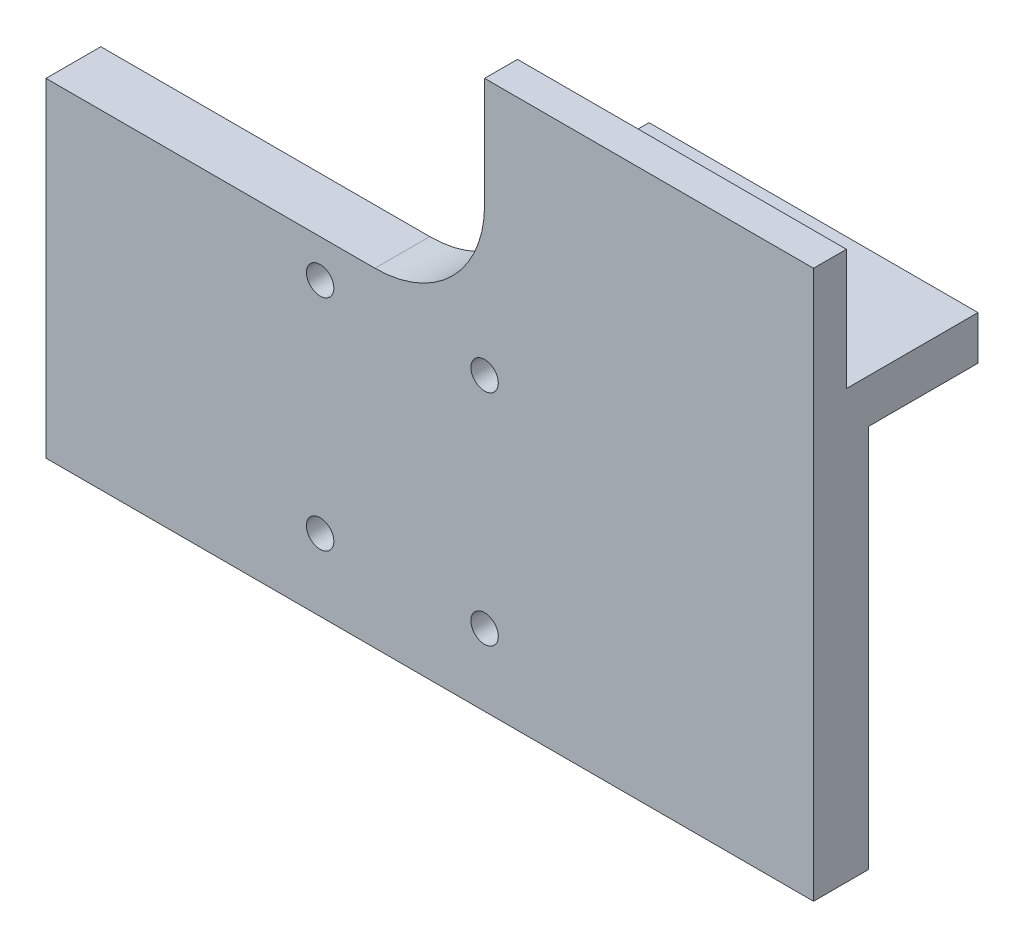
ISO-10303-21;
HEADER;
FILE_DESCRIPTION(('STEP AP214'),'2;1');
FILE_NAME('part.step','',(''),(''),'','','');
FILE_SCHEMA(('AUTOMOTIVE_DESIGN { 1 0 10303 214 1 1 1 1 }'));
ENDSEC;
DATA;
#1=APPLICATION_CONTEXT('core data for automotive mechanical design processes');
#2=APPLICATION_PROTOCOL_DEFINITION('international standard','automotive_design',2000,#1);
#3=PRODUCT_CONTEXT('',#1,'mechanical');
#4=PRODUCT('Part','Part','',(#3));
#5=PRODUCT_RELATED_PRODUCT_CATEGORY('part','',(#4));
#6=PRODUCT_DEFINITION_FORMATION('','',#4);
#7=PRODUCT_DEFINITION_CONTEXT('part definition',#1,'design');
#8=PRODUCT_DEFINITION('design','',#6,#7);
#9=PRODUCT_DEFINITION_SHAPE('','',#8);
#10=(LENGTH_UNIT() NAMED_UNIT(*) SI_UNIT(.MILLI.,.METRE.));
#11=(NAMED_UNIT(*) PLANE_ANGLE_UNIT() SI_UNIT($,.RADIAN.));
#12=(NAMED_UNIT(*) SI_UNIT($,.STERADIAN.) SOLID_ANGLE_UNIT());
#13=UNCERTAINTY_MEASURE_WITH_UNIT(LENGTH_MEASURE(1.E-05),#10,'distance_accuracy_value','');
#14=(GEOMETRIC_REPRESENTATION_CONTEXT(3) GLOBAL_UNCERTAINTY_ASSIGNED_CONTEXT((#13)) GLOBAL_UNIT_ASSIGNED_CONTEXT((#10,
#11,#12)) REPRESENTATION_CONTEXT('',''));
#15=CARTESIAN_POINT('',(0.,0.,0.));
#16=DIRECTION('',(0.,0.,1.));
#17=DIRECTION('',(1.,0.,0.));
#18=AXIS2_PLACEMENT_3D('',#15,#16,#17);
#19=CARTESIAN_POINT('',(30.,40.,0.));
#20=DIRECTION('',(0.,0.,1.));
#21=DIRECTION('',(1.,0.,0.));
#22=AXIS2_PLACEMENT_3D('',#19,#20,#21);
#23=PLANE('',#22);
#24=CARTESIAN_POINT('',(40.,26.55,0.));
#25=DIRECTION('',(0.,0.,1.));
#26=DIRECTION('',(1.,0.,0.));
#27=AXIS2_PLACEMENT_3D('',#24,#25,#26);
#28=CIRCLE('',#27,1.525);
#29=CARTESIAN_POINT('',(41.525,26.55,0.));
#30=VERTEX_POINT('',#29);
#31=EDGE_CURVE('E45',#30,#30,#28,.T.);
#32=ORIENTED_EDGE('',*,*,#31,.T.);
#33=EDGE_LOOP('',(#32));
#34=FACE_BOUND('',#33,.T.);
#35=CARTESIAN_POINT('',(25.,26.55,0.));
#36=DIRECTION('',(0.,0.,1.));
#37=DIRECTION('',(1.,0.,0.));
#38=AXIS2_PLACEMENT_3D('',#35,#36,#37);
#39=CIRCLE('',#38,1.525);
#40=CARTESIAN_POINT('',(26.525,26.55,0.));
#41=VERTEX_POINT('',#40);
#42=EDGE_CURVE('E246',#41,#41,#39,.T.);
#43=ORIENTED_EDGE('',*,*,#42,.T.);
#44=EDGE_LOOP('',(#43));
#45=FACE_BOUND('',#44,.T.);
#46=CARTESIAN_POINT('',(25.,6.55,0.));
#47=DIRECTION('',(0.,0.,1.));
#48=DIRECTION('',(1.,0.,0.));
#49=AXIS2_PLACEMENT_3D('',#46,#47,#48);
#50=CIRCLE('',#49,1.525);
#51=CARTESIAN_POINT('',(26.525,6.55,0.));
#52=VERTEX_POINT('',#51);
#53=EDGE_CURVE('E189',#52,#52,#50,.T.);
#54=ORIENTED_EDGE('',*,*,#53,.T.);
#55=EDGE_LOOP('',(#54));
#56=FACE_BOUND('',#55,.T.);
#57=CARTESIAN_POINT('',(40.,6.55,0.));
#58=DIRECTION('',(0.,0.,1.));
#59=DIRECTION('',(1.,0.,0.));
#60=AXIS2_PLACEMENT_3D('',#57,#58,#59);
#61=CIRCLE('',#60,1.525);
#62=CARTESIAN_POINT('',(41.525,6.55,0.));
#63=VERTEX_POINT('',#62);
#64=EDGE_CURVE('E183',#63,#63,#61,.T.);
#65=ORIENTED_EDGE('',*,*,#64,.T.);
#66=EDGE_LOOP('',(#65));
#67=FACE_BOUND('',#66,.T.);
#68=DIRECTION('',(0.,1.,0.));
#69=VECTOR('',#68,1.);
#70=CARTESIAN_POINT('',(40.,38.,0.));
#71=LINE('',#70,#69);
#72=CARTESIAN_POINT('',(40.,35.,0.));
#73=VERTEX_POINT('',#72);
#74=CARTESIAN_POINT('',(40.,39.,0.));
#75=VERTEX_POINT('',#74);
#76=EDGE_CURVE('E169',#73,#75,#71,.T.);
#77=ORIENTED_EDGE('',*,*,#76,.F.);
#78=DIRECTION('',(-1.,0.,0.));
#79=VECTOR('',#78,1.);
#80=CARTESIAN_POINT('',(70.,35.,0.));
#81=LINE('',#80,#79);
#82=CARTESIAN_POINT('',(70.,35.,0.));
#83=VERTEX_POINT('',#82);
#84=EDGE_CURVE('E147',#83,#73,#81,.T.);
#85=ORIENTED_EDGE('',*,*,#84,.F.);
#86=DIRECTION('',(0.,1.,0.));
#87=VECTOR('',#86,1.);
#88=CARTESIAN_POINT('',(70.,50.,0.));
#89=LINE('',#88,#87);
#90=CARTESIAN_POINT('',(70.,0.,0.));
#91=VERTEX_POINT('',#90);
#92=EDGE_CURVE('E143',#91,#83,#89,.T.);
#93=ORIENTED_EDGE('',*,*,#92,.F.);
#94=DIRECTION('',(1.,0.,0.));
#95=VECTOR('',#94,1.);
#96=CARTESIAN_POINT('',(0.,0.,0.));
#97=LINE('',#96,#95);
#98=CARTESIAN_POINT('',(0.,0.,0.));
#99=VERTEX_POINT('',#98);
#100=EDGE_CURVE('E218',#99,#91,#97,.T.);
#101=ORIENTED_EDGE('',*,*,#100,.F.);
#102=DIRECTION('',(0.,-1.,0.));
#103=VECTOR('',#102,1.);
#104=CARTESIAN_POINT('',(0.,0.,0.));
#105=LINE('',#104,#103);
#106=CARTESIAN_POINT('',(0.,30.,0.));
#107=VERTEX_POINT('',#106);
#108=EDGE_CURVE('E198',#107,#99,#105,.T.);
#109=ORIENTED_EDGE('',*,*,#108,.F.);
#110=DIRECTION('',(-1.,0.,0.));
#111=VECTOR('',#110,1.);
#112=CARTESIAN_POINT('',(0.,30.,0.));
#113=LINE('',#112,#111);
#114=CARTESIAN_POINT('',(30.,30.,0.));
#115=VERTEX_POINT('',#114);
#116=EDGE_CURVE('E203',#115,#107,#113,.T.);
#117=ORIENTED_EDGE('',*,*,#116,.F.);
#118=CARTESIAN_POINT('',(30.,40.,0.));
#119=DIRECTION('',(0.,0.,-1.));
#120=DIRECTION('',(1.,0.,0.));
#121=AXIS2_PLACEMENT_3D('',#118,#119,#120);
#122=CIRCLE('',#121,10.);
#123=CARTESIAN_POINT('',(40.,40.,0.));
#124=VERTEX_POINT('',#123);
#125=EDGE_CURVE('E221',#124,#115,#122,.T.);
#126=ORIENTED_EDGE('',*,*,#125,.F.);
#127=EDGE_CURVE('E173',#75,#124,#71,.T.);
#128=ORIENTED_EDGE('',*,*,#127,.F.);
#129=EDGE_LOOP('',(#77,#85,#93,#101,#109,#117,#126,#128));
#130=FACE_BOUND('',#129,.T.);
#131=ADVANCED_FACE('F37',(#34,#45,#56,#67,#130),#23,.F.);
#132=CARTESIAN_POINT('',(40.,38.,0.));
#133=DIRECTION('',(-1.,0.,0.));
#134=DIRECTION('',(0.,0.,1.));
#135=AXIS2_PLACEMENT_3D('',#132,#133,#134);
#136=PLANE('',#135);
#137=DIRECTION('',(0.,0.,1.));
#138=VECTOR('',#137,1.);
#139=CARTESIAN_POINT('',(40.,39.,-10.));
#140=LINE('',#139,#138);
#141=CARTESIAN_POINT('',(40.,39.,2.));
#142=VERTEX_POINT('',#141);
#143=EDGE_CURVE('E52',#75,#142,#140,.T.);
#144=ORIENTED_EDGE('',*,*,#143,.F.);
#145=ORIENTED_EDGE('',*,*,#127,.T.);
#146=DIRECTION('',(0.,0.,-1.));
#147=VECTOR('',#146,1.);
#148=CARTESIAN_POINT('',(40.,40.,5.));
#149=LINE('',#148,#147);
#150=CARTESIAN_POINT('',(40.,40.,2.));
#151=VERTEX_POINT('',#150);
#152=EDGE_CURVE('E172',#124,#151,#149,.F.);
#153=ORIENTED_EDGE('',*,*,#152,.T.);
#154=DIRECTION('',(0.,1.,0.));
#155=VECTOR('',#154,1.);
#156=CARTESIAN_POINT('',(40.,38.,2.));
#157=LINE('',#156,#155);
#158=EDGE_CURVE('E176',#142,#151,#157,.T.);
#159=ORIENTED_EDGE('',*,*,#158,.F.);
#160=EDGE_LOOP('',(#144,#145,#153,#159));
#161=FACE_BOUND('',#160,.T.);
#162=ADVANCED_FACE('F290',(#161),#136,.F.);
#163=CARTESIAN_POINT('',(40.,38.,2.));
#164=DIRECTION('',(0.,0.,1.));
#165=DIRECTION('',(1.,0.,0.));
#166=AXIS2_PLACEMENT_3D('',#163,#164,#165);
#167=PLANE('',#166);
#168=DIRECTION('',(1.,0.,0.));
#169=VECTOR('',#168,1.);
#170=CARTESIAN_POINT('',(70.,39.,2.));
#171=LINE('',#170,#169);
#172=CARTESIAN_POINT('',(70.,39.,2.));
#173=VERTEX_POINT('',#172);
#174=EDGE_CURVE('E60',#142,#173,#171,.T.);
#175=ORIENTED_EDGE('',*,*,#174,.F.);
#176=ORIENTED_EDGE('',*,*,#158,.T.);
#177=CARTESIAN_POINT('',(40.,50.,2.));
#178=VERTEX_POINT('',#177);
#179=EDGE_CURVE('E168',#151,#178,#157,.T.);
#180=ORIENTED_EDGE('',*,*,#179,.T.);
#181=DIRECTION('',(1.,0.,0.));
#182=VECTOR('',#181,1.);
#183=CARTESIAN_POINT('',(40.,50.,2.));
#184=LINE('',#183,#182);
#185=CARTESIAN_POINT('',(70.,50.,2.));
#186=VERTEX_POINT('',#185);
#187=EDGE_CURVE('E165',#178,#186,#184,.T.);
#188=ORIENTED_EDGE('',*,*,#187,.T.);
#189=DIRECTION('',(0.,1.,0.));
#190=VECTOR('',#189,1.);
#191=CARTESIAN_POINT('',(70.,38.,2.));
#192=LINE('',#191,#190);
#193=EDGE_CURVE('E174',#173,#186,#192,.T.);
#194=ORIENTED_EDGE('',*,*,#193,.F.);
#195=EDGE_LOOP('',(#175,#176,#180,#188,#194));
#196=FACE_BOUND('',#195,.T.);
#197=ADVANCED_FACE('F267',(#196),#167,.F.);
#198=CARTESIAN_POINT('',(40.,26.55,5.));
#199=DIRECTION('',(0.,0.,1.));
#200=DIRECTION('',(1.,0.,0.));
#201=AXIS2_PLACEMENT_3D('',#198,#199,#200);
#202=CYLINDRICAL_SURFACE('',#201,1.24999999999999);
#203=CARTESIAN_POINT('',(40.,26.55,0.275));
#204=DIRECTION('',(0.,0.,1.));
#205=DIRECTION('',(1.,0.,0.));
#206=AXIS2_PLACEMENT_3D('',#203,#204,#205);
#207=CIRCLE('',#206,1.25);
#208=CARTESIAN_POINT('',(41.25,26.55,0.275));
#209=VERTEX_POINT('',#208);
#210=EDGE_CURVE('E11',#209,#209,#207,.T.);
#211=ORIENTED_EDGE('',*,*,#210,.F.);
#212=EDGE_LOOP('',(#211));
#213=FACE_BOUND('',#212,.T.);
#214=CARTESIAN_POINT('',(40.,26.55,5.));
#215=DIRECTION('',(0.,0.,1.));
#216=DIRECTION('',(1.,0.,0.));
#217=AXIS2_PLACEMENT_3D('',#214,#215,#216);
#218=CIRCLE('',#217,1.24999999999999);
#219=CARTESIAN_POINT('',(41.25,26.55,5.));
#220=VERTEX_POINT('',#219);
#221=EDGE_CURVE('E252',#220,#220,#218,.T.);
#222=ORIENTED_EDGE('',*,*,#221,.T.);
#223=EDGE_LOOP('',(#222));
#224=FACE_BOUND('',#223,.T.);
#225=ADVANCED_FACE('F39',(#213,#224),#202,.F.);
#226=CARTESIAN_POINT('',(40.,26.55,0.275));
#227=DIRECTION('',(0.,0.,-1.));
#228=DIRECTION('',(-1.,0.,0.));
#229=AXIS2_PLACEMENT_3D('',#226,#227,#228);
#230=CONICAL_SURFACE('',#229,1.25,0.785398163397448);
#231=ORIENTED_EDGE('',*,*,#31,.F.);
#232=EDGE_LOOP('',(#231));
#233=FACE_BOUND('',#232,.T.);
#234=ORIENTED_EDGE('',*,*,#210,.T.);
#235=EDGE_LOOP('',(#234));
#236=FACE_BOUND('',#235,.T.);
#237=ADVANCED_FACE('F259',(#233,#236),#230,.F.);
#238=CARTESIAN_POINT('',(25.,26.55,5.));
#239=DIRECTION('',(0.,0.,1.));
#240=DIRECTION('',(1.,0.,0.));
#241=AXIS2_PLACEMENT_3D('',#238,#239,#240);
#242=CYLINDRICAL_SURFACE('',#241,1.24999999999999);
#243=CARTESIAN_POINT('',(25.,26.55,0.275));
#244=DIRECTION('',(0.,0.,1.));
#245=DIRECTION('',(1.,0.,0.));
#246=AXIS2_PLACEMENT_3D('',#243,#244,#245);
#247=CIRCLE('',#246,1.25);
#248=CARTESIAN_POINT('',(26.25,26.55,0.275));
#249=VERTEX_POINT('',#248);
#250=EDGE_CURVE('E249',#249,#249,#247,.T.);
#251=ORIENTED_EDGE('',*,*,#250,.F.);
#252=EDGE_LOOP('',(#251));
#253=FACE_BOUND('',#252,.T.);
#254=CARTESIAN_POINT('',(25.,26.55,5.));
#255=DIRECTION('',(0.,0.,1.));
#256=DIRECTION('',(1.,0.,0.));
#257=AXIS2_PLACEMENT_3D('',#254,#255,#256);
#258=CIRCLE('',#257,1.24999999999999);
#259=CARTESIAN_POINT('',(26.25,26.55,5.));
#260=VERTEX_POINT('',#259);
#261=EDGE_CURVE('E243',#260,#260,#258,.T.);
#262=ORIENTED_EDGE('',*,*,#261,.T.);
#263=EDGE_LOOP('',(#262));
#264=FACE_BOUND('',#263,.T.);
#265=ADVANCED_FACE('F262',(#253,#264),#242,.F.);
#266=CARTESIAN_POINT('',(25.,26.55,0.275));
#267=DIRECTION('',(0.,0.,-1.));
#268=DIRECTION('',(-1.,0.,0.));
#269=AXIS2_PLACEMENT_3D('',#266,#267,#268);
#270=CONICAL_SURFACE('',#269,1.25,0.785398163397448);
#271=ORIENTED_EDGE('',*,*,#42,.F.);
#272=EDGE_LOOP('',(#271));
#273=FACE_BOUND('',#272,.T.);
#274=ORIENTED_EDGE('',*,*,#250,.T.);
#275=EDGE_LOOP('',(#274));
#276=FACE_BOUND('',#275,.T.);
#277=ADVANCED_FACE('F316',(#273,#276),#270,.F.);
#278=CARTESIAN_POINT('',(0.,0.,5.));
#279=DIRECTION('',(1.,0.,0.));
#280=DIRECTION('',(0.,0.,-1.));
#281=AXIS2_PLACEMENT_3D('',#278,#279,#280);
#282=PLANE('',#281);
#283=ORIENTED_EDGE('',*,*,#108,.T.);
#284=DIRECTION('',(0.,0.,-1.));
#285=VECTOR('',#284,1.);
#286=CARTESIAN_POINT('',(0.,0.,5.));
#287=LINE('',#286,#285);
#288=CARTESIAN_POINT('',(0.,0.,5.));
#289=VERTEX_POINT('',#288);
#290=EDGE_CURVE('E240',#289,#99,#287,.T.);
#291=ORIENTED_EDGE('',*,*,#290,.F.);
#292=DIRECTION('',(0.,-1.,0.));
#293=VECTOR('',#292,1.);
#294=CARTESIAN_POINT('',(0.,0.,5.));
#295=LINE('',#294,#293);
#296=CARTESIAN_POINT('',(0.,30.,5.));
#297=VERTEX_POINT('',#296);
#298=EDGE_CURVE('E199',#297,#289,#295,.T.);
#299=ORIENTED_EDGE('',*,*,#298,.F.);
#300=DIRECTION('',(0.,0.,-1.));
#301=VECTOR('',#300,1.);
#302=CARTESIAN_POINT('',(0.,30.,5.));
#303=LINE('',#302,#301);
#304=EDGE_CURVE('E215',#297,#107,#303,.T.);
#305=ORIENTED_EDGE('',*,*,#304,.T.);
#306=EDGE_LOOP('',(#283,#291,#299,#305));
#307=FACE_BOUND('',#306,.T.);
#308=ADVANCED_FACE('F312',(#307),#282,.F.);
#309=CARTESIAN_POINT('',(0.,0.,5.));
#310=DIRECTION('',(0.,1.,0.));
#311=DIRECTION('',(0.,0.,1.));
#312=AXIS2_PLACEMENT_3D('',#309,#310,#311);
#313=PLANE('',#312);
#314=ORIENTED_EDGE('',*,*,#100,.T.);
#315=DIRECTION('',(0.,0.,-1.));
#316=VECTOR('',#315,1.);
#317=CARTESIAN_POINT('',(70.,0.,5.));
#318=LINE('',#317,#316);
#319=CARTESIAN_POINT('',(70.,0.,5.));
#320=VERTEX_POINT('',#319);
#321=EDGE_CURVE('E238',#320,#91,#318,.T.);
#322=ORIENTED_EDGE('',*,*,#321,.F.);
#323=DIRECTION('',(1.,0.,0.));
#324=VECTOR('',#323,1.);
#325=CARTESIAN_POINT('',(0.,0.,5.));
#326=LINE('',#325,#324);
#327=EDGE_CURVE('E202',#289,#320,#326,.T.);
#328=ORIENTED_EDGE('',*,*,#327,.F.);
#329=ORIENTED_EDGE('',*,*,#290,.T.);
#330=EDGE_LOOP('',(#314,#322,#328,#329));
#331=FACE_BOUND('',#330,.T.);
#332=ADVANCED_FACE('F309',(#331),#313,.F.);
#333=CARTESIAN_POINT('',(70.,50.,5.));
#334=DIRECTION('',(-1.,0.,0.));
#335=DIRECTION('',(0.,-1.,0.));
#336=AXIS2_PLACEMENT_3D('',#333,#334,#335);
#337=PLANE('',#336);
#338=DIRECTION('',(0.,0.,1.));
#339=VECTOR('',#338,1.);
#340=CARTESIAN_POINT('',(70.,39.,-10.));
#341=LINE('',#340,#339);
#342=CARTESIAN_POINT('',(70.,39.,-10.));
#343=VERTEX_POINT('',#342);
#344=EDGE_CURVE('E159',#343,#173,#341,.T.);
#345=ORIENTED_EDGE('',*,*,#344,.T.);
#346=ORIENTED_EDGE('',*,*,#193,.T.);
#347=DIRECTION('',(0.,0.,-1.));
#348=VECTOR('',#347,1.);
#349=CARTESIAN_POINT('',(70.,50.,5.));
#350=LINE('',#349,#348);
#351=CARTESIAN_POINT('',(70.,50.,5.));
#352=VERTEX_POINT('',#351);
#353=EDGE_CURVE('E235',#352,#186,#350,.T.);
#354=ORIENTED_EDGE('',*,*,#353,.F.);
#355=DIRECTION('',(0.,1.,0.));
#356=VECTOR('',#355,1.);
#357=CARTESIAN_POINT('',(70.,50.,5.));
#358=LINE('',#357,#356);
#359=EDGE_CURVE('E205',#320,#352,#358,.T.);
#360=ORIENTED_EDGE('',*,*,#359,.F.);
#361=ORIENTED_EDGE('',*,*,#321,.T.);
#362=ORIENTED_EDGE('',*,*,#92,.T.);
#363=DIRECTION('',(0.,0.,1.));
#364=VECTOR('',#363,1.);
#365=CARTESIAN_POINT('',(70.,35.,-10.));
#366=LINE('',#365,#364);
#367=CARTESIAN_POINT('',(70.,35.,-10.));
#368=VERTEX_POINT('',#367);
#369=EDGE_CURVE('E139',#368,#83,#366,.T.);
#370=ORIENTED_EDGE('',*,*,#369,.F.);
#371=DIRECTION('',(0.,-1.,0.));
#372=VECTOR('',#371,1.);
#373=CARTESIAN_POINT('',(70.,38.,-10.));
#374=LINE('',#373,#372);
#375=EDGE_CURVE('E126',#343,#368,#374,.T.);
#376=ORIENTED_EDGE('',*,*,#375,.F.);
#377=EDGE_LOOP('',(#345,#346,#354,#360,#361,#362,#370,#376));
#378=FACE_BOUND('',#377,.T.);
#379=ADVANCED_FACE('F140',(#378),#337,.F.);
#380=CARTESIAN_POINT('',(40.,50.,5.));
#381=DIRECTION('',(0.,-1.,0.));
#382=DIRECTION('',(0.,0.,-1.));
#383=AXIS2_PLACEMENT_3D('',#380,#381,#382);
#384=PLANE('',#383);
#385=ORIENTED_EDGE('',*,*,#353,.T.);
#386=ORIENTED_EDGE('',*,*,#187,.F.);
#387=DIRECTION('',(0.,0.,-1.));
#388=VECTOR('',#387,1.);
#389=CARTESIAN_POINT('',(40.,50.,5.));
#390=LINE('',#389,#388);
#391=CARTESIAN_POINT('',(40.,50.,5.));
#392=VERTEX_POINT('',#391);
#393=EDGE_CURVE('E232',#392,#178,#390,.T.);
#394=ORIENTED_EDGE('',*,*,#393,.F.);
#395=DIRECTION('',(-1.,0.,0.));
#396=VECTOR('',#395,1.);
#397=CARTESIAN_POINT('',(40.,50.,5.));
#398=LINE('',#397,#396);
#399=EDGE_CURVE('E207',#352,#392,#398,.T.);
#400=ORIENTED_EDGE('',*,*,#399,.F.);
#401=EDGE_LOOP('',(#385,#386,#394,#400));
#402=FACE_BOUND('',#401,.T.);
#403=ADVANCED_FACE('F302',(#402),#384,.F.);
#404=CARTESIAN_POINT('',(40.,40.,5.));
#405=DIRECTION('',(1.,0.,0.));
#406=DIRECTION('',(0.,1.,0.));
#407=AXIS2_PLACEMENT_3D('',#404,#405,#406);
#408=PLANE('',#407);
#409=ORIENTED_EDGE('',*,*,#393,.T.);
#410=ORIENTED_EDGE('',*,*,#179,.F.);
#411=DIRECTION('',(0.,0.,-1.));
#412=VECTOR('',#411,1.);
#413=CARTESIAN_POINT('',(40.,40.,5.));
#414=LINE('',#413,#412);
#415=CARTESIAN_POINT('',(40.,40.,5.));
#416=VERTEX_POINT('',#415);
#417=EDGE_CURVE('E229',#416,#151,#414,.T.);
#418=ORIENTED_EDGE('',*,*,#417,.F.);
#419=DIRECTION('',(0.,-1.,0.));
#420=VECTOR('',#419,1.);
#421=CARTESIAN_POINT('',(40.,40.,5.));
#422=LINE('',#421,#420);
#423=EDGE_CURVE('E209',#392,#416,#422,.T.);
#424=ORIENTED_EDGE('',*,*,#423,.F.);
#425=EDGE_LOOP('',(#409,#410,#418,#424));
#426=FACE_BOUND('',#425,.T.);
#427=ADVANCED_FACE('F298',(#426),#408,.F.);
#428=CARTESIAN_POINT('',(30.,40.,5.));
#429=DIRECTION('',(0.,0.,-1.));
#430=DIRECTION('',(-1.,0.,0.));
#431=AXIS2_PLACEMENT_3D('',#428,#429,#430);
#432=CYLINDRICAL_SURFACE('',#431,10.);
#433=ORIENTED_EDGE('',*,*,#125,.T.);
#434=DIRECTION('',(0.,0.,-1.));
#435=VECTOR('',#434,1.);
#436=CARTESIAN_POINT('',(30.,30.,5.));
#437=LINE('',#436,#435);
#438=CARTESIAN_POINT('',(30.,30.,5.));
#439=VERTEX_POINT('',#438);
#440=EDGE_CURVE('E226',#439,#115,#437,.T.);
#441=ORIENTED_EDGE('',*,*,#440,.F.);
#442=CARTESIAN_POINT('',(30.,40.,5.));
#443=DIRECTION('',(0.,0.,-1.));
#444=DIRECTION('',(1.,0.,0.));
#445=AXIS2_PLACEMENT_3D('',#442,#443,#444);
#446=CIRCLE('',#445,10.);
#447=EDGE_CURVE('E211',#416,#439,#446,.T.);
#448=ORIENTED_EDGE('',*,*,#447,.F.);
#449=ORIENTED_EDGE('',*,*,#417,.T.);
#450=ORIENTED_EDGE('',*,*,#152,.F.);
#451=EDGE_LOOP('',(#433,#441,#448,#449,#450));
#452=FACE_BOUND('',#451,.T.);
#453=ADVANCED_FACE('F283',(#452),#432,.F.);
#454=CARTESIAN_POINT('',(0.,30.,5.));
#455=DIRECTION('',(0.,-1.,0.));
#456=DIRECTION('',(0.,0.,-1.));
#457=AXIS2_PLACEMENT_3D('',#454,#455,#456);
#458=PLANE('',#457);
#459=ORIENTED_EDGE('',*,*,#116,.T.);
#460=ORIENTED_EDGE('',*,*,#304,.F.);
#461=DIRECTION('',(-1.,0.,0.));
#462=VECTOR('',#461,1.);
#463=CARTESIAN_POINT('',(0.,30.,5.));
#464=LINE('',#463,#462);
#465=EDGE_CURVE('E213',#439,#297,#464,.T.);
#466=ORIENTED_EDGE('',*,*,#465,.F.);
#467=ORIENTED_EDGE('',*,*,#440,.T.);
#468=EDGE_LOOP('',(#459,#460,#466,#467));
#469=FACE_BOUND('',#468,.T.);
#470=ADVANCED_FACE('F273',(#469),#458,.F.);
#471=CARTESIAN_POINT('',(30.,40.,5.));
#472=DIRECTION('',(0.,0.,1.));
#473=DIRECTION('',(1.,0.,0.));
#474=AXIS2_PLACEMENT_3D('',#471,#472,#473);
#475=PLANE('',#474);
#476=CARTESIAN_POINT('',(40.,6.55,5.));
#477=DIRECTION('',(0.,0.,1.));
#478=DIRECTION('',(1.,0.,0.));
#479=AXIS2_PLACEMENT_3D('',#476,#477,#478);
#480=CIRCLE('',#479,1.24999999999999);
#481=CARTESIAN_POINT('',(41.25,6.55,5.));
#482=VERTEX_POINT('',#481);
#483=EDGE_CURVE('E180',#482,#482,#480,.T.);
#484=ORIENTED_EDGE('',*,*,#483,.F.);
#485=EDGE_LOOP('',(#484));
#486=FACE_BOUND('',#485,.T.);
#487=CARTESIAN_POINT('',(25.,6.55,5.));
#488=DIRECTION('',(0.,0.,1.));
#489=DIRECTION('',(1.,0.,0.));
#490=AXIS2_PLACEMENT_3D('',#487,#488,#489);
#491=CIRCLE('',#490,1.24999999999999);
#492=CARTESIAN_POINT('',(26.25,6.55,5.));
#493=VERTEX_POINT('',#492);
#494=EDGE_CURVE('E192',#493,#493,#491,.T.);
#495=ORIENTED_EDGE('',*,*,#494,.F.);
#496=EDGE_LOOP('',(#495));
#497=FACE_BOUND('',#496,.T.);
#498=ORIENTED_EDGE('',*,*,#298,.T.);
#499=ORIENTED_EDGE('',*,*,#327,.T.);
#500=ORIENTED_EDGE('',*,*,#359,.T.);
#501=ORIENTED_EDGE('',*,*,#399,.T.);
#502=ORIENTED_EDGE('',*,*,#423,.T.);
#503=ORIENTED_EDGE('',*,*,#447,.T.);
#504=ORIENTED_EDGE('',*,*,#465,.T.);
#505=EDGE_LOOP('',(#498,#499,#500,#501,#502,#503,#504));
#506=FACE_BOUND('',#505,.T.);
#507=ORIENTED_EDGE('',*,*,#261,.F.);
#508=EDGE_LOOP('',(#507));
#509=FACE_BOUND('',#508,.T.);
#510=ORIENTED_EDGE('',*,*,#221,.F.);
#511=EDGE_LOOP('',(#510));
#512=FACE_BOUND('',#511,.T.);
#513=ADVANCED_FACE('F270',(#486,#497,#506,#509,#512),#475,.T.);
#514=CARTESIAN_POINT('',(25.,6.55,0.275));
#515=DIRECTION('',(0.,0.,-1.));
#516=DIRECTION('',(-1.,0.,0.));
#517=AXIS2_PLACEMENT_3D('',#514,#515,#516);
#518=CONICAL_SURFACE('',#517,1.25,0.785398163397448);
#519=ORIENTED_EDGE('',*,*,#53,.F.);
#520=EDGE_LOOP('',(#519));
#521=FACE_BOUND('',#520,.T.);
#522=CARTESIAN_POINT('',(25.,6.55,0.275));
#523=DIRECTION('',(0.,0.,1.));
#524=DIRECTION('',(1.,0.,0.));
#525=AXIS2_PLACEMENT_3D('',#522,#523,#524);
#526=CIRCLE('',#525,1.25);
#527=CARTESIAN_POINT('',(26.25,6.55,0.275));
#528=VERTEX_POINT('',#527);
#529=EDGE_CURVE('E195',#528,#528,#526,.T.);
#530=ORIENTED_EDGE('',*,*,#529,.T.);
#531=EDGE_LOOP('',(#530));
#532=FACE_BOUND('',#531,.T.);
#533=ADVANCED_FACE('F272',(#521,#532),#518,.F.);
#534=CARTESIAN_POINT('',(25.,6.55,5.));
#535=DIRECTION('',(0.,0.,1.));
#536=DIRECTION('',(1.,0.,0.));
#537=AXIS2_PLACEMENT_3D('',#534,#535,#536);
#538=CYLINDRICAL_SURFACE('',#537,1.24999999999999);
#539=ORIENTED_EDGE('',*,*,#529,.F.);
#540=EDGE_LOOP('',(#539));
#541=FACE_BOUND('',#540,.T.);
#542=ORIENTED_EDGE('',*,*,#494,.T.);
#543=EDGE_LOOP('',(#542));
#544=FACE_BOUND('',#543,.T.);
#545=ADVANCED_FACE('F280',(#541,#544),#538,.F.);
#546=CARTESIAN_POINT('',(40.,6.55,0.275));
#547=DIRECTION('',(0.,0.,-1.));
#548=DIRECTION('',(-1.,0.,0.));
#549=AXIS2_PLACEMENT_3D('',#546,#547,#548);
#550=CONICAL_SURFACE('',#549,1.25,0.785398163397448);
#551=ORIENTED_EDGE('',*,*,#64,.F.);
#552=EDGE_LOOP('',(#551));
#553=FACE_BOUND('',#552,.T.);
#554=CARTESIAN_POINT('',(40.,6.55,0.275));
#555=DIRECTION('',(0.,0.,1.));
#556=DIRECTION('',(1.,0.,0.));
#557=AXIS2_PLACEMENT_3D('',#554,#555,#556);
#558=CIRCLE('',#557,1.25);
#559=CARTESIAN_POINT('',(41.25,6.55,0.275));
#560=VERTEX_POINT('',#559);
#561=EDGE_CURVE('E186',#560,#560,#558,.T.);
#562=ORIENTED_EDGE('',*,*,#561,.T.);
#563=EDGE_LOOP('',(#562));
#564=FACE_BOUND('',#563,.T.);
#565=ADVANCED_FACE('F388',(#553,#564),#550,.F.);
#566=CARTESIAN_POINT('',(40.,6.55,5.));
#567=DIRECTION('',(0.,0.,1.));
#568=DIRECTION('',(1.,0.,0.));
#569=AXIS2_PLACEMENT_3D('',#566,#567,#568);
#570=CYLINDRICAL_SURFACE('',#569,1.24999999999999);
#571=ORIENTED_EDGE('',*,*,#561,.F.);
#572=EDGE_LOOP('',(#571));
#573=FACE_BOUND('',#572,.T.);
#574=ORIENTED_EDGE('',*,*,#483,.T.);
#575=EDGE_LOOP('',(#574));
#576=FACE_BOUND('',#575,.T.);
#577=ADVANCED_FACE('F429',(#573,#576),#570,.F.);
#578=CARTESIAN_POINT('',(40.,38.,-10.));
#579=DIRECTION('',(1.,0.,0.));
#580=DIRECTION('',(0.,0.,-1.));
#581=AXIS2_PLACEMENT_3D('',#578,#579,#580);
#582=PLANE('',#581);
#583=DIRECTION('',(0.,1.,0.));
#584=VECTOR('',#583,1.);
#585=CARTESIAN_POINT('',(40.,38.,-10.));
#586=LINE('',#585,#584);
#587=CARTESIAN_POINT('',(40.,35.,-10.));
#588=VERTEX_POINT('',#587);
#589=CARTESIAN_POINT('',(40.,39.,-10.));
#590=VERTEX_POINT('',#589);
#591=EDGE_CURVE('E136',#588,#590,#586,.T.);
#592=ORIENTED_EDGE('',*,*,#591,.F.);
#593=DIRECTION('',(0.,0.,-1.));
#594=VECTOR('',#593,1.);
#595=CARTESIAN_POINT('',(40.,35.,0.));
#596=LINE('',#595,#594);
#597=EDGE_CURVE('E152',#73,#588,#596,.T.);
#598=ORIENTED_EDGE('',*,*,#597,.F.);
#599=ORIENTED_EDGE('',*,*,#76,.T.);
#600=EDGE_CURVE('E162',#590,#75,#140,.T.);
#601=ORIENTED_EDGE('',*,*,#600,.F.);
#602=EDGE_LOOP('',(#592,#598,#599,#601));
#603=FACE_BOUND('',#602,.T.);
#604=ADVANCED_FACE('F438',(#603),#582,.F.);
#605=CARTESIAN_POINT('',(70.,39.,-10.));
#606=DIRECTION('',(0.,-1.,0.));
#607=DIRECTION('',(0.,0.,-1.));
#608=AXIS2_PLACEMENT_3D('',#605,#606,#607);
#609=PLANE('',#608);
#610=ORIENTED_EDGE('',*,*,#174,.T.);
#611=ORIENTED_EDGE('',*,*,#344,.F.);
#612=DIRECTION('',(1.,0.,0.));
#613=VECTOR('',#612,1.);
#614=CARTESIAN_POINT('',(70.,39.,-10.));
#615=LINE('',#614,#613);
#616=EDGE_CURVE('E132',#590,#343,#615,.T.);
#617=ORIENTED_EDGE('',*,*,#616,.F.);
#618=ORIENTED_EDGE('',*,*,#600,.T.);
#619=ORIENTED_EDGE('',*,*,#143,.T.);
#620=EDGE_LOOP('',(#610,#611,#617,#618,#619));
#621=FACE_BOUND('',#620,.T.);
#622=ADVANCED_FACE('F480',(#621),#609,.F.);
#623=CARTESIAN_POINT('',(0.,0.,-10.));
#624=DIRECTION('',(0.,0.,1.));
#625=DIRECTION('',(1.,0.,0.));
#626=AXIS2_PLACEMENT_3D('',#623,#624,#625);
#627=PLANE('',#626);
#628=ORIENTED_EDGE('',*,*,#375,.T.);
#629=DIRECTION('',(1.,0.,0.));
#630=VECTOR('',#629,1.);
#631=CARTESIAN_POINT('',(40.,35.,-10.));
#632=LINE('',#631,#630);
#633=EDGE_CURVE('E130',#588,#368,#632,.T.);
#634=ORIENTED_EDGE('',*,*,#633,.F.);
#635=ORIENTED_EDGE('',*,*,#591,.T.);
#636=ORIENTED_EDGE('',*,*,#616,.T.);
#637=EDGE_LOOP('',(#628,#634,#635,#636));
#638=FACE_BOUND('',#637,.T.);
#639=ADVANCED_FACE('F128',(#638),#627,.F.);
#640=CARTESIAN_POINT('',(0.,35.,0.));
#641=DIRECTION('',(0.,-1.,0.));
#642=DIRECTION('',(0.,0.,-1.));
#643=AXIS2_PLACEMENT_3D('',#640,#641,#642);
#644=PLANE('',#643);
#645=ORIENTED_EDGE('',*,*,#633,.T.);
#646=ORIENTED_EDGE('',*,*,#369,.T.);
#647=ORIENTED_EDGE('',*,*,#84,.T.);
#648=ORIENTED_EDGE('',*,*,#597,.T.);
#649=EDGE_LOOP('',(#645,#646,#647,#648));
#650=FACE_BOUND('',#649,.T.);
#651=ADVANCED_FACE('F150',(#650),#644,.T.);
#652=CLOSED_SHELL('',(#131,#162,#197,#225,#237,#265,#277,#308,#332,#379,#403,#427,#453,#470,
#513,#533,#545,#565,#577,#604,#622,#639,#651));
#653=MANIFOLD_SOLID_BREP('B2',#652);
#654=ADVANCED_BREP_SHAPE_REPRESENTATION('',(#18,#653),#14);
#655=SHAPE_DEFINITION_REPRESENTATION(#9,#654);
ENDSEC;
END-ISO-10303-21;
